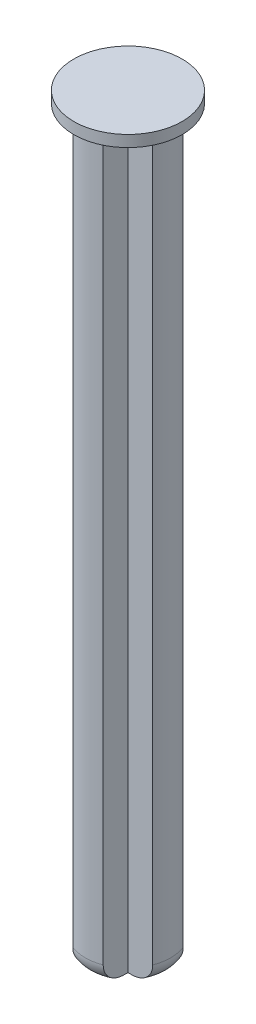
ISO-10303-21;
HEADER;
FILE_DESCRIPTION(('STEP AP214'),'2;1');
FILE_NAME('part.step','',(''),(''),'','','');
FILE_SCHEMA(('AUTOMOTIVE_DESIGN { 1 0 10303 214 1 1 1 1 }'));
ENDSEC;
DATA;
#1=APPLICATION_CONTEXT('core data for automotive mechanical design processes');
#2=APPLICATION_PROTOCOL_DEFINITION('international standard','automotive_design',2000,#1);
#3=PRODUCT_CONTEXT('',#1,'mechanical');
#4=PRODUCT('Part','Part','',(#3));
#5=PRODUCT_RELATED_PRODUCT_CATEGORY('part','',(#4));
#6=PRODUCT_DEFINITION_FORMATION('','',#4);
#7=PRODUCT_DEFINITION_CONTEXT('part definition',#1,'design');
#8=PRODUCT_DEFINITION('design','',#6,#7);
#9=PRODUCT_DEFINITION_SHAPE('','',#8);
#10=(LENGTH_UNIT() NAMED_UNIT(*) SI_UNIT(.MILLI.,.METRE.));
#11=(NAMED_UNIT(*) PLANE_ANGLE_UNIT() SI_UNIT($,.RADIAN.));
#12=(NAMED_UNIT(*) SI_UNIT($,.STERADIAN.) SOLID_ANGLE_UNIT());
#13=UNCERTAINTY_MEASURE_WITH_UNIT(LENGTH_MEASURE(1.E-05),#10,'distance_accuracy_value','');
#14=(GEOMETRIC_REPRESENTATION_CONTEXT(3) GLOBAL_UNCERTAINTY_ASSIGNED_CONTEXT((#13)) GLOBAL_UNIT_ASSIGNED_CONTEXT((#10,
#11,#12)) REPRESENTATION_CONTEXT('',''));
#15=CARTESIAN_POINT('',(0.,0.,0.));
#16=DIRECTION('',(0.,0.,1.));
#17=DIRECTION('',(1.,0.,0.));
#18=AXIS2_PLACEMENT_3D('',#15,#16,#17);
#19=CARTESIAN_POINT('',(0.,85.1639610306789,0.8));
#20=DIRECTION('',(0.,0.,1.));
#21=DIRECTION('',(1.,0.,0.));
#22=AXIS2_PLACEMENT_3D('',#19,#20,#21);
#23=PLANE('',#22);
#24=DIRECTION('',(0.,-1.,0.));
#25=VECTOR('',#24,1.);
#26=CARTESIAN_POINT('',(-0.8,85.1639610306789,0.8));
#27=LINE('',#26,#25);
#28=CARTESIAN_POINT('',(-0.8,38.8,0.8));
#29=VERTEX_POINT('',#28);
#30=CARTESIAN_POINT('',(-0.8,0.,0.8));
#31=VERTEX_POINT('',#30);
#32=EDGE_CURVE('E157',#29,#31,#27,.T.);
#33=ORIENTED_EDGE('',*,*,#32,.F.);
#34=DIRECTION('',(-1.,0.,0.));
#35=VECTOR('',#34,1.);
#36=CARTESIAN_POINT('',(0.,38.8,0.8));
#37=LINE('',#36,#35);
#38=CARTESIAN_POINT('',(-2.10297408448131,38.8,0.8));
#39=VERTEX_POINT('',#38);
#40=EDGE_CURVE('E51',#29,#39,#37,.T.);
#41=ORIENTED_EDGE('',*,*,#40,.T.);
#42=DIRECTION('',(0.,-1.,0.));
#43=VECTOR('',#42,1.);
#44=CARTESIAN_POINT('',(-2.10297408448131,85.1639610306789,0.8));
#45=LINE('',#44,#43);
#46=CARTESIAN_POINT('',(-2.10297408448131,1.,0.8));
#47=VERTEX_POINT('',#46);
#48=EDGE_CURVE('E203',#39,#47,#45,.T.);
#49=ORIENTED_EDGE('',*,*,#48,.T.);
#50=CARTESIAN_POINT('',(-2.10297408448131,1.,0.8));
#51=CARTESIAN_POINT('',(-2.10297441519099,0.973387600106504,0.8));
#52=CARTESIAN_POINT('',(-2.10183671881926,0.946788234788772,0.8));
#53=CARTESIAN_POINT('',(-2.09730154814578,0.893786150099357,0.8));
#54=CARTESIAN_POINT('',(-2.09390435395547,0.867383406762535,0.8));
#55=CARTESIAN_POINT('',(-2.08037447490767,0.788872479617725,0.8));
#56=CARTESIAN_POINT('',(-2.06690326307456,0.7373008130706,0.8));
#57=CARTESIAN_POINT('',(-2.03151447242179,0.637172746290927,0.8));
#58=CARTESIAN_POINT('',(-2.00959603399031,0.588616653515142,0.8));
#59=CARTESIAN_POINT('',(-1.95804557689708,0.495772279122224,0.8));
#60=CARTESIAN_POINT('',(-1.92841114725091,0.451485337406586,0.8));
#61=CARTESIAN_POINT('',(-1.86181339090263,0.367545303764267,0.8));
#62=CARTESIAN_POINT('',(-1.82473011063944,0.327987628350848,0.8));
#63=CARTESIAN_POINT('',(-1.74478452152165,0.255294523486733,0.8));
#64=CARTESIAN_POINT('',(-1.70192492685613,0.222156095461802,0.8));
#65=CARTESIAN_POINT('',(-1.60918015266492,0.16115265864421,0.8));
#66=CARTESIAN_POINT('',(-1.5590375501905,0.1336805187422,0.8));
#67=CARTESIAN_POINT('',(-1.45506030984878,0.0865883798840226,0.8));
#68=CARTESIAN_POINT('',(-1.40121656393664,0.0669886276664464,0.8));
#69=CARTESIAN_POINT('',(-1.30858063711562,0.0404545276200822,0.8));
#70=CARTESIAN_POINT('',(-1.27035259773507,0.0314760707552039,0.8));
#71=CARTESIAN_POINT('',(-1.19321105841374,0.0169711994033569,0.8));
#72=CARTESIAN_POINT('',(-1.15429696866066,0.0114479207597324,0.8));
#73=CARTESIAN_POINT('',(-1.07635302904717,0.00363245821079271,0.8));
#74=CARTESIAN_POINT('',(-1.03732467890741,0.00132458626135063,0.8));
#75=CARTESIAN_POINT('',(-0.95928016050169,-0.000465922976817975,0.8));
#76=CARTESIAN_POINT('',(-0.92026413581677,4.55719735898565E-05,0.8));
#77=CARTESIAN_POINT('',(-0.881330460618863,0.00178541253676217,0.8));
#78=B_SPLINE_CURVE_WITH_KNOTS('',3,(#50,#51,#52,#53,#54,#55,#56,#57,#58,#59,#60,#61,#62,#63,#64,
#65,#66,#67,#68,#69,#70,#71,#72,#73,#74,#75,#76,#77),.UNSPECIFIED.,.F.,.F.,(4,2,2,2,2,2,2,2,2,2,
2,2,2,4),(0.,0.0797871430217843,0.15956439662156,0.318642814270302,0.477737424430208,
0.636881806018965,0.798830788459493,0.960703937505235,1.13152701481513,1.30278665579144,
1.4204396107989,1.53819919069752,1.65538218256064,1.77232138146314),.UNSPECIFIED.);
#79=CARTESIAN_POINT('',(-0.960468635614927,0.,0.8));
#80=VERTEX_POINT('',#79);
#81=EDGE_CURVE('E247',#47,#80,#78,.T.);
#82=ORIENTED_EDGE('',*,*,#81,.T.);
#83=DIRECTION('',(-1.,0.,0.));
#84=VECTOR('',#83,1.);
#85=CARTESIAN_POINT('',(0.,0.,0.8));
#86=LINE('',#85,#84);
#87=EDGE_CURVE('E172',#31,#80,#86,.T.);
#88=ORIENTED_EDGE('',*,*,#87,.F.);
#89=EDGE_LOOP('',(#33,#41,#49,#82,#88));
#90=FACE_BOUND('',#89,.T.);
#91=ADVANCED_FACE('F35',(#90),#23,.T.);
#92=CARTESIAN_POINT('',(0.,85.1639610306789,0.));
#93=DIRECTION('',(0.,-1.,0.));
#94=DIRECTION('',(0.,0.,-1.));
#95=AXIS2_PLACEMENT_3D('',#92,#93,#94);
#96=CYLINDRICAL_SURFACE('',#95,2.25);
#97=CARTESIAN_POINT('',(0.,38.8,0.));
#98=DIRECTION('',(0.,1.,0.));
#99=DIRECTION('',(0.,0.,1.));
#100=AXIS2_PLACEMENT_3D('',#97,#98,#99);
#101=CIRCLE('',#100,2.25);
#102=CARTESIAN_POINT('',(-2.10297408448131,38.8,-0.8));
#103=VERTEX_POINT('',#102);
#104=EDGE_CURVE('E58',#103,#39,#101,.T.);
#105=ORIENTED_EDGE('',*,*,#104,.F.);
#106=DIRECTION('',(0.,-1.,0.));
#107=VECTOR('',#106,1.);
#108=CARTESIAN_POINT('',(-2.10297408448131,85.1639610306789,-0.8));
#109=LINE('',#108,#107);
#110=CARTESIAN_POINT('',(-2.10297408448131,1.,-0.8));
#111=VERTEX_POINT('',#110);
#112=EDGE_CURVE('E217',#103,#111,#109,.T.);
#113=ORIENTED_EDGE('',*,*,#112,.T.);
#114=CARTESIAN_POINT('',(0.,1.,0.));
#115=DIRECTION('',(0.,1.,0.));
#116=DIRECTION('',(0.,0.,1.));
#117=AXIS2_PLACEMENT_3D('',#114,#115,#116);
#118=CIRCLE('',#117,2.25);
#119=EDGE_CURVE('E229',#111,#47,#118,.T.);
#120=ORIENTED_EDGE('',*,*,#119,.T.);
#121=ORIENTED_EDGE('',*,*,#48,.F.);
#122=EDGE_LOOP('',(#105,#113,#120,#121));
#123=FACE_BOUND('',#122,.T.);
#124=ADVANCED_FACE('F258',(#123),#96,.T.);
#125=CARTESIAN_POINT('',(0.,85.1639610306789,-0.799999999999999));
#126=DIRECTION('',(0.,0.,1.));
#127=DIRECTION('',(1.,0.,0.));
#128=AXIS2_PLACEMENT_3D('',#125,#126,#127);
#129=PLANE('',#128);
#130=DIRECTION('',(-1.,0.,0.));
#131=VECTOR('',#130,1.);
#132=CARTESIAN_POINT('',(0.,38.8,-0.799999999999999));
#133=LINE('',#132,#131);
#134=CARTESIAN_POINT('',(-0.8,38.8,-0.799999999999999));
#135=VERTEX_POINT('',#134);
#136=EDGE_CURVE('E177',#135,#103,#133,.T.);
#137=ORIENTED_EDGE('',*,*,#136,.F.);
#138=DIRECTION('',(0.,-1.,0.));
#139=VECTOR('',#138,1.);
#140=CARTESIAN_POINT('',(-0.8,85.1639610306789,-0.799999999999999));
#141=LINE('',#140,#139);
#142=CARTESIAN_POINT('',(-0.8,0.,-0.799999999999999));
#143=VERTEX_POINT('',#142);
#144=EDGE_CURVE('E185',#135,#143,#141,.T.);
#145=ORIENTED_EDGE('',*,*,#144,.T.);
#146=DIRECTION('',(-1.,0.,0.));
#147=VECTOR('',#146,1.);
#148=CARTESIAN_POINT('',(0.,0.,-0.799999999999999));
#149=LINE('',#148,#147);
#150=CARTESIAN_POINT('',(-0.960468635614927,0.,-0.799999999999999));
#151=VERTEX_POINT('',#150);
#152=EDGE_CURVE('E181',#143,#151,#149,.T.);
#153=ORIENTED_EDGE('',*,*,#152,.T.);
#154=CARTESIAN_POINT('',(-2.10297408448131,1.,-0.8));
#155=CARTESIAN_POINT('',(-2.10297441519099,0.973387600106504,-0.8));
#156=CARTESIAN_POINT('',(-2.10183671881926,0.946788234788772,-0.8));
#157=CARTESIAN_POINT('',(-2.09730154814578,0.893786150099357,-0.8));
#158=CARTESIAN_POINT('',(-2.09390435395547,0.867383406762535,-0.8));
#159=CARTESIAN_POINT('',(-2.08037447490767,0.788872479617725,-0.8));
#160=CARTESIAN_POINT('',(-2.06690326307456,0.7373008130706,-0.8));
#161=CARTESIAN_POINT('',(-2.03151447242179,0.637172746290927,-0.8));
#162=CARTESIAN_POINT('',(-2.00959603399031,0.588616653515141,-0.8));
#163=CARTESIAN_POINT('',(-1.95804557689708,0.495772279122224,-0.8));
#164=CARTESIAN_POINT('',(-1.92841114725091,0.451485337406586,-0.8));
#165=CARTESIAN_POINT('',(-1.86181339090263,0.367545303764267,-0.8));
#166=CARTESIAN_POINT('',(-1.82473011063944,0.327987628350848,-0.8));
#167=CARTESIAN_POINT('',(-1.74478452152165,0.255294523486733,-0.8));
#168=CARTESIAN_POINT('',(-1.70192492685613,0.222156095461802,-0.8));
#169=CARTESIAN_POINT('',(-1.60918015266492,0.161152658644209,-0.8));
#170=CARTESIAN_POINT('',(-1.5590375501905,0.1336805187422,-0.8));
#171=CARTESIAN_POINT('',(-1.45506030984878,0.0865883798840224,-0.8));
#172=CARTESIAN_POINT('',(-1.40121656393664,0.0669886276664461,-0.8));
#173=CARTESIAN_POINT('',(-1.30858063711562,0.040454527620082,-0.8));
#174=CARTESIAN_POINT('',(-1.27035259773507,0.0314760707552038,-0.8));
#175=CARTESIAN_POINT('',(-1.19321105841374,0.0169711994033569,-0.8));
#176=CARTESIAN_POINT('',(-1.15429696866066,0.0114479207597322,-0.8));
#177=CARTESIAN_POINT('',(-1.07635302904717,0.00363245821079254,-0.8));
#178=CARTESIAN_POINT('',(-1.03732467890741,0.00132458626135053,-0.8));
#179=CARTESIAN_POINT('',(-0.95928016050169,-0.000465922976817944,-0.8));
#180=CARTESIAN_POINT('',(-0.92026413581677,4.55719735899408E-05,-0.8));
#181=CARTESIAN_POINT('',(-0.881330460618863,0.00178541253676218,-0.799999999999999));
#182=B_SPLINE_CURVE_WITH_KNOTS('',3,(#154,#155,#156,#157,#158,#159,#160,#161,#162,#163,#164,
#165,#166,#167,#168,#169,#170,#171,#172,#173,#174,#175,#176,#177,#178,#179,#180,#181),
.UNSPECIFIED.,.F.,.F.,(4,2,2,2,2,2,2,2,2,2,2,2,2,4),(0.,0.0797871430217844,0.15956439662156,
0.318642814270302,0.477737424430208,0.636881806018965,0.798830788459493,0.960703937505235,
1.13152701481513,1.30278665579144,1.4204396107989,1.53819919069752,1.65538218256064,
1.77232138146314),.UNSPECIFIED.);
#183=EDGE_CURVE('E205',#151,#111,#182,.F.);
#184=ORIENTED_EDGE('',*,*,#183,.T.);
#185=ORIENTED_EDGE('',*,*,#112,.F.);
#186=EDGE_LOOP('',(#137,#145,#153,#184,#185));
#187=FACE_BOUND('',#186,.T.);
#188=ADVANCED_FACE('F231',(#187),#129,.F.);
#189=CARTESIAN_POINT('',(-0.8,85.1639610306789,0.));
#190=DIRECTION('',(1.,0.,0.));
#191=DIRECTION('',(0.,0.,-1.));
#192=AXIS2_PLACEMENT_3D('',#189,#190,#191);
#193=PLANE('',#192);
#194=DIRECTION('',(0.,0.,1.));
#195=VECTOR('',#194,1.);
#196=CARTESIAN_POINT('',(-0.8,38.8,0.));
#197=LINE('',#196,#195);
#198=CARTESIAN_POINT('',(-0.8,38.8,-2.10297408448131));
#199=VERTEX_POINT('',#198);
#200=EDGE_CURVE('E272',#199,#135,#197,.T.);
#201=ORIENTED_EDGE('',*,*,#200,.F.);
#202=DIRECTION('',(0.,-1.,0.));
#203=VECTOR('',#202,1.);
#204=CARTESIAN_POINT('',(-0.8,85.1639610306789,-2.10297408448131));
#205=LINE('',#204,#203);
#206=CARTESIAN_POINT('',(-0.8,1.,-2.10297408448131));
#207=VERTEX_POINT('',#206);
#208=EDGE_CURVE('E184',#199,#207,#205,.T.);
#209=ORIENTED_EDGE('',*,*,#208,.T.);
#210=CARTESIAN_POINT('',(-0.8,0.,-0.960468635614925));
#211=CARTESIAN_POINT('',(-0.8,-1.61764964313199E-05,-1.00089695630695));
#212=CARTESIAN_POINT('',(-0.8,0.00144818212186802,-1.04135644001157));
#213=CARTESIAN_POINT('',(-0.8,0.00767669478763478,-1.12210556981698));
#214=CARTESIAN_POINT('',(-0.8,0.0124481206118231,-1.16239464440969));
#215=CARTESIAN_POINT('',(-0.8,0.0256616351639781,-1.2425662880405));
#216=CARTESIAN_POINT('',(-0.8,0.0341198463909614,-1.282446275031));
#217=CARTESIAN_POINT('',(-0.8,0.0549081289711817,-1.36114029720907));
#218=CARTESIAN_POINT('',(-0.8,0.0672343933106843,-1.3999553398635));
#219=CARTESIAN_POINT('',(-0.8,0.102795963285697,-1.4944179562022));
#220=CARTESIAN_POINT('',(-0.8,0.12842720292967,-1.54919260462306));
#221=CARTESIAN_POINT('',(-0.8,0.188375508128817,-1.65360012896897));
#222=CARTESIAN_POINT('',(-0.8,0.222670443257998,-1.70324565812819));
#223=CARTESIAN_POINT('',(-0.8,0.299616852426918,-1.79603926480535));
#224=CARTESIAN_POINT('',(-0.8,0.342309233498008,-1.83915362988897));
#225=CARTESIAN_POINT('',(-0.8,0.43488345070996,-1.9168989589252));
#226=CARTESIAN_POINT('',(-0.8,0.48476794590266,-1.95152677240901));
#227=CARTESIAN_POINT('',(-0.8,0.58612472520233,-2.00855639669966));
#228=CARTESIAN_POINT('',(-0.8,0.637186654384494,-2.03168854833522));
#229=CARTESIAN_POINT('',(-0.8,0.742571357803405,-2.06858837607197));
#230=CARTESIAN_POINT('',(-0.8,0.796892659430562,-2.08236024706169));
#231=CARTESIAN_POINT('',(-0.8,0.904612915528465,-2.09961483561991));
#232=CARTESIAN_POINT('',(-0.8,0.957940063237049,-2.10354013891284));
#233=CARTESIAN_POINT('',(-0.8,1.03783619721989,-2.1025903267386));
#234=CARTESIAN_POINT('',(-0.8,1.06448423244251,-2.10112824842795));
#235=CARTESIAN_POINT('',(-0.8,1.11756125080896,-2.09593591392812));
#236=CARTESIAN_POINT('',(-0.8,1.14399021113603,-2.09220542441802));
#237=CARTESIAN_POINT('',(-0.8,1.17022385903395,-2.0873517630733));
#238=B_SPLINE_CURVE_WITH_KNOTS('',3,(#210,#211,#212,#213,#214,#215,#216,#217,#218,#219,#220,
#221,#222,#223,#224,#225,#226,#227,#228,#229,#230,#231,#232,#233,#234,#235,#236,#237),
.UNSPECIFIED.,.F.,.F.,(4,2,2,2,2,2,2,2,2,2,2,2,2,4),(0.,0.121303589835471,0.242874758970373,
0.364982984046552,0.486971402768664,0.667571261450087,0.847714382291364,1.02875780759105,
1.20986834031537,1.37718388598393,1.5444243982526,1.70400101691868,1.78398051140163,
1.86396823369),.UNSPECIFIED.);
#239=CARTESIAN_POINT('',(-0.8,0.,-0.960468635614925));
#240=VERTEX_POINT('',#239);
#241=EDGE_CURVE('E386',#207,#240,#238,.F.);
#242=ORIENTED_EDGE('',*,*,#241,.T.);
#243=DIRECTION('',(0.,0.,1.));
#244=VECTOR('',#243,1.);
#245=CARTESIAN_POINT('',(-0.8,0.,0.));
#246=LINE('',#245,#244);
#247=EDGE_CURVE('E186',#240,#143,#246,.T.);
#248=ORIENTED_EDGE('',*,*,#247,.T.);
#249=ORIENTED_EDGE('',*,*,#144,.F.);
#250=EDGE_LOOP('',(#201,#209,#242,#248,#249));
#251=FACE_BOUND('',#250,.T.);
#252=ADVANCED_FACE('F263',(#251),#193,.F.);
#253=CARTESIAN_POINT('',(0.,85.1639610306789,0.));
#254=DIRECTION('',(0.,-1.,0.));
#255=DIRECTION('',(0.,0.,-1.));
#256=AXIS2_PLACEMENT_3D('',#253,#254,#255);
#257=CYLINDRICAL_SURFACE('',#256,2.25);
#258=CARTESIAN_POINT('',(0.,38.8,0.));
#259=DIRECTION('',(0.,1.,0.));
#260=DIRECTION('',(0.,0.,1.));
#261=AXIS2_PLACEMENT_3D('',#258,#259,#260);
#262=CIRCLE('',#261,2.25);
#263=CARTESIAN_POINT('',(0.8,38.8,-2.10297408448131));
#264=VERTEX_POINT('',#263);
#265=EDGE_CURVE('E279',#264,#199,#262,.T.);
#266=ORIENTED_EDGE('',*,*,#265,.F.);
#267=DIRECTION('',(0.,-1.,0.));
#268=VECTOR('',#267,1.);
#269=CARTESIAN_POINT('',(0.8,85.1639610306789,-2.10297408448131));
#270=LINE('',#269,#268);
#271=CARTESIAN_POINT('',(0.8,1.,-2.10297408448131));
#272=VERTEX_POINT('',#271);
#273=EDGE_CURVE('E189',#264,#272,#270,.T.);
#274=ORIENTED_EDGE('',*,*,#273,.T.);
#275=CARTESIAN_POINT('',(0.,1.,0.));
#276=DIRECTION('',(0.,1.,0.));
#277=DIRECTION('',(0.,0.,1.));
#278=AXIS2_PLACEMENT_3D('',#275,#276,#277);
#279=CIRCLE('',#278,2.25);
#280=EDGE_CURVE('E44',#272,#207,#279,.T.);
#281=ORIENTED_EDGE('',*,*,#280,.T.);
#282=ORIENTED_EDGE('',*,*,#208,.F.);
#283=EDGE_LOOP('',(#266,#274,#281,#282));
#284=FACE_BOUND('',#283,.T.);
#285=ADVANCED_FACE('F268',(#284),#257,.T.);
#286=CARTESIAN_POINT('',(0.8,85.1639610306789,0.));
#287=DIRECTION('',(1.,0.,0.));
#288=DIRECTION('',(0.,0.,-1.));
#289=AXIS2_PLACEMENT_3D('',#286,#287,#288);
#290=PLANE('',#289);
#291=ORIENTED_EDGE('',*,*,#273,.F.);
#292=DIRECTION('',(0.,0.,1.));
#293=VECTOR('',#292,1.);
#294=CARTESIAN_POINT('',(0.8,38.8,0.));
#295=LINE('',#294,#293);
#296=CARTESIAN_POINT('',(0.8,38.8,-0.799999999999999));
#297=VERTEX_POINT('',#296);
#298=EDGE_CURVE('E281',#264,#297,#295,.T.);
#299=ORIENTED_EDGE('',*,*,#298,.T.);
#300=DIRECTION('',(0.,-1.,0.));
#301=VECTOR('',#300,1.);
#302=CARTESIAN_POINT('',(0.8,85.1639610306789,-0.799999999999999));
#303=LINE('',#302,#301);
#304=CARTESIAN_POINT('',(0.8,0.,-0.799999999999999));
#305=VERTEX_POINT('',#304);
#306=EDGE_CURVE('E212',#297,#305,#303,.T.);
#307=ORIENTED_EDGE('',*,*,#306,.T.);
#308=DIRECTION('',(0.,0.,1.));
#309=VECTOR('',#308,1.);
#310=CARTESIAN_POINT('',(0.8,0.,0.));
#311=LINE('',#310,#309);
#312=CARTESIAN_POINT('',(0.8,0.,-0.960468635614925));
#313=VERTEX_POINT('',#312);
#314=EDGE_CURVE('E175',#313,#305,#311,.T.);
#315=ORIENTED_EDGE('',*,*,#314,.F.);
#316=CARTESIAN_POINT('',(0.8,1.,-2.10297408448131));
#317=CARTESIAN_POINT('',(0.8,0.973387600106505,-2.10297441519099));
#318=CARTESIAN_POINT('',(0.8,0.946788234788772,-2.10183671881926));
#319=CARTESIAN_POINT('',(0.8,0.893786150099357,-2.09730154814578));
#320=CARTESIAN_POINT('',(0.8,0.867383406762535,-2.09390435395547));
#321=CARTESIAN_POINT('',(0.8,0.788872479617725,-2.08037447490767));
#322=CARTESIAN_POINT('',(0.8,0.7373008130706,-2.06690326307456));
#323=CARTESIAN_POINT('',(0.8,0.637172746290927,-2.03151447242179));
#324=CARTESIAN_POINT('',(0.8,0.588616653515142,-2.0095960339903));
#325=CARTESIAN_POINT('',(0.8,0.495772279122224,-1.95804557689707));
#326=CARTESIAN_POINT('',(0.8,0.451485337406586,-1.92841114725091));
#327=CARTESIAN_POINT('',(0.8,0.367545303764267,-1.86181339090263));
#328=CARTESIAN_POINT('',(0.8,0.327987628350848,-1.82473011063944));
#329=CARTESIAN_POINT('',(0.8,0.255294523486733,-1.74478452152165));
#330=CARTESIAN_POINT('',(0.8,0.222156095461802,-1.70192492685613));
#331=CARTESIAN_POINT('',(0.8,0.16115265864421,-1.60918015266492));
#332=CARTESIAN_POINT('',(0.8,0.1336805187422,-1.5590375501905));
#333=CARTESIAN_POINT('',(0.8,0.0865883798840228,-1.45506030984878));
#334=CARTESIAN_POINT('',(0.8,0.0669886276664466,-1.40121656393664));
#335=CARTESIAN_POINT('',(0.8,0.0404545276200823,-1.30858063711561));
#336=CARTESIAN_POINT('',(0.8,0.0314760707552039,-1.27035259773506));
#337=CARTESIAN_POINT('',(0.8,0.0169711994033569,-1.19321105841374));
#338=CARTESIAN_POINT('',(0.8,0.0114479207597323,-1.15429696866065));
#339=CARTESIAN_POINT('',(0.8,0.00363245821079272,-1.07635302904717));
#340=CARTESIAN_POINT('',(0.8,0.00132458626135065,-1.03732467890741));
#341=CARTESIAN_POINT('',(0.8,-0.000465922976817923,-0.959280160501689));
#342=CARTESIAN_POINT('',(0.8,4.55719735899429E-05,-0.920264135816769));
#343=CARTESIAN_POINT('',(0.8,0.00178541253676232,-0.881330460618862));
#344=B_SPLINE_CURVE_WITH_KNOTS('',3,(#316,#317,#318,#319,#320,#321,#322,#323,#324,#325,#326,
#327,#328,#329,#330,#331,#332,#333,#334,#335,#336,#337,#338,#339,#340,#341,#342,#343),
.UNSPECIFIED.,.F.,.F.,(4,2,2,2,2,2,2,2,2,2,2,2,2,4),(0.,0.079787143021784,0.159564396621559,
0.318642814270301,0.477737424430208,0.636881806018965,0.798830788459493,0.960703937505235,
1.13152701481513,1.30278665579144,1.4204396107989,1.53819919069752,1.65538218256064,
1.77232138146314),.UNSPECIFIED.);
#345=EDGE_CURVE('E390',#313,#272,#344,.F.);
#346=ORIENTED_EDGE('',*,*,#345,.T.);
#347=EDGE_LOOP('',(#291,#299,#307,#315,#346));
#348=FACE_BOUND('',#347,.T.);
#349=ADVANCED_FACE('F369',(#348),#290,.T.);
#350=CARTESIAN_POINT('',(0.,85.1639610306789,-0.8));
#351=DIRECTION('',(0.,0.,1.));
#352=DIRECTION('',(1.,0.,0.));
#353=AXIS2_PLACEMENT_3D('',#350,#351,#352);
#354=PLANE('',#353);
#355=DIRECTION('',(-1.,0.,0.));
#356=VECTOR('',#355,1.);
#357=CARTESIAN_POINT('',(0.,38.8,-0.8));
#358=LINE('',#357,#356);
#359=CARTESIAN_POINT('',(2.10297408448131,38.8,-0.799999999999999));
#360=VERTEX_POINT('',#359);
#361=EDGE_CURVE('E285',#360,#297,#358,.T.);
#362=ORIENTED_EDGE('',*,*,#361,.F.);
#363=DIRECTION('',(0.,-1.,0.));
#364=VECTOR('',#363,1.);
#365=CARTESIAN_POINT('',(2.10297408448131,85.1639610306789,-0.799999999999999));
#366=LINE('',#365,#364);
#367=CARTESIAN_POINT('',(2.10297408448131,1.,-0.799999999999999));
#368=VERTEX_POINT('',#367);
#369=EDGE_CURVE('E197',#360,#368,#366,.T.);
#370=ORIENTED_EDGE('',*,*,#369,.T.);
#371=CARTESIAN_POINT('',(0.960468635614927,0.,-0.799999999999999));
#372=CARTESIAN_POINT('',(1.00089695630696,-1.61764964313008E-05,-0.799999999999999));
#373=CARTESIAN_POINT('',(1.04135644001157,0.00144818212186804,-0.799999999999999));
#374=CARTESIAN_POINT('',(1.12210556981698,0.00767669478763476,-0.799999999999999));
#375=CARTESIAN_POINT('',(1.16239464440969,0.0124481206118231,-0.799999999999999));
#376=CARTESIAN_POINT('',(1.2425662880405,0.025661635163978,-0.799999999999999));
#377=CARTESIAN_POINT('',(1.28244627503101,0.0341198463909612,-0.799999999999999));
#378=CARTESIAN_POINT('',(1.36114029720907,0.0549081289711815,-0.799999999999999));
#379=CARTESIAN_POINT('',(1.3999553398635,0.0672343933106841,-0.799999999999999));
#380=CARTESIAN_POINT('',(1.4944179562022,0.102795963285696,-0.799999999999999));
#381=CARTESIAN_POINT('',(1.54919260462306,0.128427202929669,-0.799999999999999));
#382=CARTESIAN_POINT('',(1.65360012896897,0.188375508128816,-0.799999999999999));
#383=CARTESIAN_POINT('',(1.70324565812819,0.222670443257998,-0.799999999999999));
#384=CARTESIAN_POINT('',(1.79603926480535,0.299616852426918,-0.799999999999999));
#385=CARTESIAN_POINT('',(1.83915362988897,0.342309233498007,-0.799999999999999));
#386=CARTESIAN_POINT('',(1.9168989589252,0.43488345070996,-0.799999999999999));
#387=CARTESIAN_POINT('',(1.95152677240901,0.48476794590266,-0.799999999999999));
#388=CARTESIAN_POINT('',(2.00855639669967,0.58612472520233,-0.799999999999999));
#389=CARTESIAN_POINT('',(2.03168854833522,0.637186654384494,-0.799999999999999));
#390=CARTESIAN_POINT('',(2.06858837607197,0.742571357803405,-0.799999999999999));
#391=CARTESIAN_POINT('',(2.08236024706169,0.796892659430562,-0.799999999999999));
#392=CARTESIAN_POINT('',(2.09961483561991,0.904612915528465,-0.799999999999999));
#393=CARTESIAN_POINT('',(2.10354013891284,0.957940063237049,-0.799999999999999));
#394=CARTESIAN_POINT('',(2.1025903267386,1.03783619721989,-0.799999999999999));
#395=CARTESIAN_POINT('',(2.10112824842796,1.06448423244251,-0.799999999999999));
#396=CARTESIAN_POINT('',(2.09593591392812,1.11756125080897,-0.799999999999999));
#397=CARTESIAN_POINT('',(2.09220542441802,1.14399021113603,-0.799999999999999));
#398=CARTESIAN_POINT('',(2.0873517630733,1.17022385903395,-0.799999999999999));
#399=B_SPLINE_CURVE_WITH_KNOTS('',3,(#371,#372,#373,#374,#375,#376,#377,#378,#379,#380,#381,
#382,#383,#384,#385,#386,#387,#388,#389,#390,#391,#392,#393,#394,#395,#396,#397,#398),
.UNSPECIFIED.,.F.,.F.,(4,2,2,2,2,2,2,2,2,2,2,2,2,4),(0.,0.121303589835471,0.242874758970373,
0.364982984046551,0.486971402768663,0.667571261450086,0.847714382291363,1.02875780759104,
1.20986834031536,1.37718388598393,1.5444243982526,1.70400101691868,1.78398051140163,
1.86396823369),.UNSPECIFIED.);
#400=CARTESIAN_POINT('',(0.960468635614927,0.,-0.799999999999999));
#401=VERTEX_POINT('',#400);
#402=EDGE_CURVE('E328',#368,#401,#399,.F.);
#403=ORIENTED_EDGE('',*,*,#402,.T.);
#404=DIRECTION('',(-1.,0.,0.));
#405=VECTOR('',#404,1.);
#406=CARTESIAN_POINT('',(0.,0.,-0.8));
#407=LINE('',#406,#405);
#408=EDGE_CURVE('E193',#401,#305,#407,.T.);
#409=ORIENTED_EDGE('',*,*,#408,.T.);
#410=ORIENTED_EDGE('',*,*,#306,.F.);
#411=EDGE_LOOP('',(#362,#370,#403,#409,#410));
#412=FACE_BOUND('',#411,.T.);
#413=ADVANCED_FACE('F338',(#412),#354,.F.);
#414=CARTESIAN_POINT('',(0.,85.1639610306789,0.));
#415=DIRECTION('',(0.,-1.,0.));
#416=DIRECTION('',(0.,0.,-1.));
#417=AXIS2_PLACEMENT_3D('',#414,#415,#416);
#418=CYLINDRICAL_SURFACE('',#417,2.25);
#419=CARTESIAN_POINT('',(0.,38.8,0.));
#420=DIRECTION('',(0.,1.,0.));
#421=DIRECTION('',(0.,0.,1.));
#422=AXIS2_PLACEMENT_3D('',#419,#420,#421);
#423=CIRCLE('',#422,2.25);
#424=CARTESIAN_POINT('',(2.10297408448131,38.8,0.8));
#425=VERTEX_POINT('',#424);
#426=EDGE_CURVE('E288',#425,#360,#423,.T.);
#427=ORIENTED_EDGE('',*,*,#426,.F.);
#428=DIRECTION('',(0.,-1.,0.));
#429=VECTOR('',#428,1.);
#430=CARTESIAN_POINT('',(2.10297408448131,85.1639610306789,0.8));
#431=LINE('',#430,#429);
#432=CARTESIAN_POINT('',(2.10297408448131,1.,0.8));
#433=VERTEX_POINT('',#432);
#434=EDGE_CURVE('E196',#425,#433,#431,.T.);
#435=ORIENTED_EDGE('',*,*,#434,.T.);
#436=CARTESIAN_POINT('',(0.,1.,0.));
#437=DIRECTION('',(0.,1.,0.));
#438=DIRECTION('',(0.,0.,1.));
#439=AXIS2_PLACEMENT_3D('',#436,#437,#438);
#440=CIRCLE('',#439,2.25);
#441=EDGE_CURVE('E355',#433,#368,#440,.T.);
#442=ORIENTED_EDGE('',*,*,#441,.T.);
#443=ORIENTED_EDGE('',*,*,#369,.F.);
#444=EDGE_LOOP('',(#427,#435,#442,#443));
#445=FACE_BOUND('',#444,.T.);
#446=ADVANCED_FACE('F361',(#445),#418,.T.);
#447=CARTESIAN_POINT('',(0.,85.1639610306789,0.8));
#448=DIRECTION('',(0.,0.,1.));
#449=DIRECTION('',(1.,0.,0.));
#450=AXIS2_PLACEMENT_3D('',#447,#448,#449);
#451=PLANE('',#450);
#452=ORIENTED_EDGE('',*,*,#434,.F.);
#453=DIRECTION('',(-1.,0.,0.));
#454=VECTOR('',#453,1.);
#455=CARTESIAN_POINT('',(0.,38.8,0.8));
#456=LINE('',#455,#454);
#457=CARTESIAN_POINT('',(0.8,38.8,0.8));
#458=VERTEX_POINT('',#457);
#459=EDGE_CURVE('E291',#425,#458,#456,.T.);
#460=ORIENTED_EDGE('',*,*,#459,.T.);
#461=DIRECTION('',(0.,-1.,0.));
#462=VECTOR('',#461,1.);
#463=CARTESIAN_POINT('',(0.8,85.1639610306789,0.8));
#464=LINE('',#463,#462);
#465=CARTESIAN_POINT('',(0.8,0.,0.8));
#466=VERTEX_POINT('',#465);
#467=EDGE_CURVE('E208',#458,#466,#464,.T.);
#468=ORIENTED_EDGE('',*,*,#467,.T.);
#469=DIRECTION('',(-1.,0.,0.));
#470=VECTOR('',#469,1.);
#471=CARTESIAN_POINT('',(0.,0.,0.8));
#472=LINE('',#471,#470);
#473=CARTESIAN_POINT('',(0.960468635614926,0.,0.8));
#474=VERTEX_POINT('',#473);
#475=EDGE_CURVE('E192',#474,#466,#472,.T.);
#476=ORIENTED_EDGE('',*,*,#475,.F.);
#477=CARTESIAN_POINT('',(2.10297408448131,1.,0.8));
#478=CARTESIAN_POINT('',(2.10297441519099,0.973387600106504,0.8));
#479=CARTESIAN_POINT('',(2.10183671881926,0.946788234788772,0.8));
#480=CARTESIAN_POINT('',(2.09730154814578,0.893786150099357,0.8));
#481=CARTESIAN_POINT('',(2.09390435395547,0.867383406762535,0.8));
#482=CARTESIAN_POINT('',(2.08037447490767,0.788872479617725,0.8));
#483=CARTESIAN_POINT('',(2.06690326307456,0.7373008130706,0.8));
#484=CARTESIAN_POINT('',(2.03151447242179,0.637172746290927,0.8));
#485=CARTESIAN_POINT('',(2.00959603399031,0.588616653515141,0.8));
#486=CARTESIAN_POINT('',(1.95804557689708,0.495772279122224,0.8));
#487=CARTESIAN_POINT('',(1.92841114725091,0.451485337406586,0.8));
#488=CARTESIAN_POINT('',(1.86181339090263,0.367545303764267,0.8));
#489=CARTESIAN_POINT('',(1.82473011063944,0.327987628350848,0.8));
#490=CARTESIAN_POINT('',(1.74478452152165,0.255294523486733,0.8));
#491=CARTESIAN_POINT('',(1.70192492685613,0.222156095461802,0.8));
#492=CARTESIAN_POINT('',(1.60918015266492,0.16115265864421,0.8));
#493=CARTESIAN_POINT('',(1.5590375501905,0.1336805187422,0.8));
#494=CARTESIAN_POINT('',(1.45506030984878,0.0865883798840226,0.8));
#495=CARTESIAN_POINT('',(1.40121656393664,0.0669886276664462,0.8));
#496=CARTESIAN_POINT('',(1.30858063711561,0.0404545276200821,0.8));
#497=CARTESIAN_POINT('',(1.27035259773507,0.0314760707552039,0.8));
#498=CARTESIAN_POINT('',(1.19321105841374,0.0169711994033569,0.8));
#499=CARTESIAN_POINT('',(1.15429696866066,0.0114479207597323,0.8));
#500=CARTESIAN_POINT('',(1.07635302904717,0.00363245821079255,0.8));
#501=CARTESIAN_POINT('',(1.03732467890741,0.00132458626135043,0.8));
#502=CARTESIAN_POINT('',(0.959280160501689,-0.000465922976818134,0.8));
#503=CARTESIAN_POINT('',(0.920264135816769,4.55719735897716E-05,0.8));
#504=CARTESIAN_POINT('',(0.881330460618862,0.00178541253676225,0.8));
#505=B_SPLINE_CURVE_WITH_KNOTS('',3,(#477,#478,#479,#480,#481,#482,#483,#484,#485,#486,#487,
#488,#489,#490,#491,#492,#493,#494,#495,#496,#497,#498,#499,#500,#501,#502,#503,#504),
.UNSPECIFIED.,.F.,.F.,(4,2,2,2,2,2,2,2,2,2,2,2,2,4),(0.,0.0797871430217843,0.15956439662156,
0.318642814270302,0.477737424430208,0.636881806018965,0.798830788459493,0.960703937505235,
1.13152701481513,1.30278665579144,1.4204396107989,1.53819919069752,1.65538218256064,
1.77232138146315),.UNSPECIFIED.);
#506=EDGE_CURVE('E347',#474,#433,#505,.F.);
#507=ORIENTED_EDGE('',*,*,#506,.T.);
#508=EDGE_LOOP('',(#452,#460,#468,#476,#507));
#509=FACE_BOUND('',#508,.T.);
#510=ADVANCED_FACE('F357',(#509),#451,.T.);
#511=CARTESIAN_POINT('',(0.8,85.1639610306789,0.));
#512=DIRECTION('',(1.,0.,0.));
#513=DIRECTION('',(0.,0.,-1.));
#514=AXIS2_PLACEMENT_3D('',#511,#512,#513);
#515=PLANE('',#514);
#516=ORIENTED_EDGE('',*,*,#467,.F.);
#517=DIRECTION('',(0.,0.,1.));
#518=VECTOR('',#517,1.);
#519=CARTESIAN_POINT('',(0.8,38.8,0.));
#520=LINE('',#519,#518);
#521=CARTESIAN_POINT('',(0.8,38.8,2.10297408448131));
#522=VERTEX_POINT('',#521);
#523=EDGE_CURVE('E166',#458,#522,#520,.T.);
#524=ORIENTED_EDGE('',*,*,#523,.T.);
#525=DIRECTION('',(0.,-1.,0.));
#526=VECTOR('',#525,1.);
#527=CARTESIAN_POINT('',(0.8,85.1639610306789,2.10297408448131));
#528=LINE('',#527,#526);
#529=CARTESIAN_POINT('',(0.8,1.,2.10297408448131));
#530=VERTEX_POINT('',#529);
#531=EDGE_CURVE('E158',#522,#530,#528,.T.);
#532=ORIENTED_EDGE('',*,*,#531,.T.);
#533=CARTESIAN_POINT('',(0.8,0.,0.960468635614925));
#534=CARTESIAN_POINT('',(0.8,-1.61764964313199E-05,1.00089695630695));
#535=CARTESIAN_POINT('',(0.8,0.00144818212186802,1.04135644001157));
#536=CARTESIAN_POINT('',(0.8,0.00767669478763478,1.12210556981698));
#537=CARTESIAN_POINT('',(0.8,0.0124481206118231,1.16239464440969));
#538=CARTESIAN_POINT('',(0.8,0.0256616351639781,1.2425662880405));
#539=CARTESIAN_POINT('',(0.8,0.0341198463909614,1.282446275031));
#540=CARTESIAN_POINT('',(0.8,0.0549081289711817,1.36114029720907));
#541=CARTESIAN_POINT('',(0.8,0.0672343933106843,1.3999553398635));
#542=CARTESIAN_POINT('',(0.8,0.102795963285697,1.4944179562022));
#543=CARTESIAN_POINT('',(0.8,0.12842720292967,1.54919260462306));
#544=CARTESIAN_POINT('',(0.8,0.188375508128817,1.65360012896897));
#545=CARTESIAN_POINT('',(0.8,0.222670443257998,1.70324565812819));
#546=CARTESIAN_POINT('',(0.8,0.299616852426918,1.79603926480535));
#547=CARTESIAN_POINT('',(0.8,0.342309233498008,1.83915362988897));
#548=CARTESIAN_POINT('',(0.8,0.43488345070996,1.9168989589252));
#549=CARTESIAN_POINT('',(0.8,0.48476794590266,1.95152677240901));
#550=CARTESIAN_POINT('',(0.8,0.58612472520233,2.00855639669966));
#551=CARTESIAN_POINT('',(0.8,0.637186654384494,2.03168854833522));
#552=CARTESIAN_POINT('',(0.8,0.742571357803405,2.06858837607197));
#553=CARTESIAN_POINT('',(0.8,0.796892659430562,2.08236024706169));
#554=CARTESIAN_POINT('',(0.8,0.904612915528465,2.09961483561991));
#555=CARTESIAN_POINT('',(0.8,0.957940063237049,2.10354013891284));
#556=CARTESIAN_POINT('',(0.8,1.03783619721989,2.1025903267386));
#557=CARTESIAN_POINT('',(0.8,1.06448423244251,2.10112824842795));
#558=CARTESIAN_POINT('',(0.8,1.11756125080896,2.09593591392812));
#559=CARTESIAN_POINT('',(0.8,1.14399021113603,2.09220542441802));
#560=CARTESIAN_POINT('',(0.8,1.17022385903395,2.0873517630733));
#561=B_SPLINE_CURVE_WITH_KNOTS('',3,(#533,#534,#535,#536,#537,#538,#539,#540,#541,#542,#543,
#544,#545,#546,#547,#548,#549,#550,#551,#552,#553,#554,#555,#556,#557,#558,#559,#560),
.UNSPECIFIED.,.F.,.F.,(4,2,2,2,2,2,2,2,2,2,2,2,2,4),(0.,0.121303589835471,0.242874758970373,
0.364982984046552,0.486971402768664,0.667571261450087,0.847714382291364,1.02875780759105,
1.20986834031537,1.37718388598393,1.5444243982526,1.70400101691868,1.78398051140163,
1.86396823369),.UNSPECIFIED.);
#562=CARTESIAN_POINT('',(0.8,0.,0.960468635614925));
#563=VERTEX_POINT('',#562);
#564=EDGE_CURVE('E422',#530,#563,#561,.F.);
#565=ORIENTED_EDGE('',*,*,#564,.T.);
#566=DIRECTION('',(0.,0.,1.));
#567=VECTOR('',#566,1.);
#568=CARTESIAN_POINT('',(0.8,0.,0.));
#569=LINE('',#568,#567);
#570=EDGE_CURVE('E200',#466,#563,#569,.T.);
#571=ORIENTED_EDGE('',*,*,#570,.F.);
#572=EDGE_LOOP('',(#516,#524,#532,#565,#571));
#573=FACE_BOUND('',#572,.T.);
#574=ADVANCED_FACE('F360',(#573),#515,.T.);
#575=CARTESIAN_POINT('',(0.,85.1639610306789,0.));
#576=DIRECTION('',(0.,-1.,0.));
#577=DIRECTION('',(0.,0.,-1.));
#578=AXIS2_PLACEMENT_3D('',#575,#576,#577);
#579=CYLINDRICAL_SURFACE('',#578,2.25);
#580=CARTESIAN_POINT('',(0.,38.8,0.));
#581=DIRECTION('',(0.,1.,0.));
#582=DIRECTION('',(0.,0.,1.));
#583=AXIS2_PLACEMENT_3D('',#580,#581,#582);
#584=CIRCLE('',#583,2.25);
#585=CARTESIAN_POINT('',(-0.8,38.8,2.10297408448131));
#586=VERTEX_POINT('',#585);
#587=EDGE_CURVE('E162',#586,#522,#584,.T.);
#588=ORIENTED_EDGE('',*,*,#587,.F.);
#589=DIRECTION('',(0.,-1.,0.));
#590=VECTOR('',#589,1.);
#591=CARTESIAN_POINT('',(-0.8,85.1639610306789,2.10297408448131));
#592=LINE('',#591,#590);
#593=CARTESIAN_POINT('',(-0.8,1.,2.10297408448131));
#594=VERTEX_POINT('',#593);
#595=EDGE_CURVE('E149',#586,#594,#592,.T.);
#596=ORIENTED_EDGE('',*,*,#595,.T.);
#597=CARTESIAN_POINT('',(0.,1.,0.));
#598=DIRECTION('',(0.,1.,0.));
#599=DIRECTION('',(0.,0.,1.));
#600=AXIS2_PLACEMENT_3D('',#597,#598,#599);
#601=CIRCLE('',#600,2.25);
#602=EDGE_CURVE('E325',#594,#530,#601,.T.);
#603=ORIENTED_EDGE('',*,*,#602,.T.);
#604=ORIENTED_EDGE('',*,*,#531,.F.);
#605=EDGE_LOOP('',(#588,#596,#603,#604));
#606=FACE_BOUND('',#605,.T.);
#607=ADVANCED_FACE('F163',(#606),#579,.T.);
#608=CARTESIAN_POINT('',(-0.8,85.1639610306789,0.));
#609=DIRECTION('',(1.,0.,0.));
#610=DIRECTION('',(0.,0.,-1.));
#611=AXIS2_PLACEMENT_3D('',#608,#609,#610);
#612=PLANE('',#611);
#613=DIRECTION('',(0.,0.,1.));
#614=VECTOR('',#613,1.);
#615=CARTESIAN_POINT('',(-0.8,38.8,0.));
#616=LINE('',#615,#614);
#617=EDGE_CURVE('E12',#29,#586,#616,.T.);
#618=ORIENTED_EDGE('',*,*,#617,.F.);
#619=ORIENTED_EDGE('',*,*,#32,.T.);
#620=DIRECTION('',(0.,0.,1.));
#621=VECTOR('',#620,1.);
#622=CARTESIAN_POINT('',(-0.8,0.,0.));
#623=LINE('',#622,#621);
#624=CARTESIAN_POINT('',(-0.8,0.,0.960468635614925));
#625=VERTEX_POINT('',#624);
#626=EDGE_CURVE('E204',#31,#625,#623,.T.);
#627=ORIENTED_EDGE('',*,*,#626,.T.);
#628=CARTESIAN_POINT('',(-0.8,1.,2.10297408448131));
#629=CARTESIAN_POINT('',(-0.8,0.973387600106505,2.10297441519099));
#630=CARTESIAN_POINT('',(-0.8,0.946788234788772,2.10183671881926));
#631=CARTESIAN_POINT('',(-0.8,0.893786150099357,2.09730154814578));
#632=CARTESIAN_POINT('',(-0.8,0.867383406762535,2.09390435395547));
#633=CARTESIAN_POINT('',(-0.8,0.788872479617725,2.08037447490767));
#634=CARTESIAN_POINT('',(-0.8,0.7373008130706,2.06690326307456));
#635=CARTESIAN_POINT('',(-0.8,0.637172746290927,2.03151447242179));
#636=CARTESIAN_POINT('',(-0.8,0.588616653515142,2.0095960339903));
#637=CARTESIAN_POINT('',(-0.8,0.495772279122224,1.95804557689707));
#638=CARTESIAN_POINT('',(-0.8,0.451485337406586,1.92841114725091));
#639=CARTESIAN_POINT('',(-0.8,0.367545303764267,1.86181339090263));
#640=CARTESIAN_POINT('',(-0.8,0.327987628350848,1.82473011063944));
#641=CARTESIAN_POINT('',(-0.8,0.255294523486733,1.74478452152165));
#642=CARTESIAN_POINT('',(-0.8,0.222156095461802,1.70192492685613));
#643=CARTESIAN_POINT('',(-0.8,0.16115265864421,1.60918015266492));
#644=CARTESIAN_POINT('',(-0.8,0.1336805187422,1.5590375501905));
#645=CARTESIAN_POINT('',(-0.8,0.0865883798840228,1.45506030984878));
#646=CARTESIAN_POINT('',(-0.8,0.0669886276664466,1.40121656393664));
#647=CARTESIAN_POINT('',(-0.8,0.0404545276200823,1.30858063711561));
#648=CARTESIAN_POINT('',(-0.8,0.0314760707552039,1.27035259773506));
#649=CARTESIAN_POINT('',(-0.8,0.0169711994033569,1.19321105841374));
#650=CARTESIAN_POINT('',(-0.8,0.0114479207597323,1.15429696866065));
#651=CARTESIAN_POINT('',(-0.8,0.00363245821079272,1.07635302904717));
#652=CARTESIAN_POINT('',(-0.8,0.00132458626135065,1.03732467890741));
#653=CARTESIAN_POINT('',(-0.8,-0.000465922976817923,0.959280160501689));
#654=CARTESIAN_POINT('',(-0.8,4.55719735899429E-05,0.920264135816769));
#655=CARTESIAN_POINT('',(-0.8,0.00178541253676232,0.881330460618862));
#656=B_SPLINE_CURVE_WITH_KNOTS('',3,(#628,#629,#630,#631,#632,#633,#634,#635,#636,#637,#638,
#639,#640,#641,#642,#643,#644,#645,#646,#647,#648,#649,#650,#651,#652,#653,#654,#655),
.UNSPECIFIED.,.F.,.F.,(4,2,2,2,2,2,2,2,2,2,2,2,2,4),(0.,0.079787143021784,0.159564396621559,
0.318642814270301,0.477737424430208,0.636881806018965,0.798830788459493,0.960703937505235,
1.13152701481513,1.30278665579144,1.4204396107989,1.53819919069752,1.65538218256064,
1.77232138146314),.UNSPECIFIED.);
#657=EDGE_CURVE('E153',#625,#594,#656,.F.);
#658=ORIENTED_EDGE('',*,*,#657,.T.);
#659=ORIENTED_EDGE('',*,*,#595,.F.);
#660=EDGE_LOOP('',(#618,#619,#627,#658,#659));
#661=FACE_BOUND('',#660,.T.);
#662=ADVANCED_FACE('F151',(#661),#612,.F.);
#663=CARTESIAN_POINT('',(0.,1.,0.));
#664=DIRECTION('',(0.,1.,0.));
#665=DIRECTION('',(0.,0.,1.));
#666=AXIS2_PLACEMENT_3D('',#663,#664,#665);
#667=TOROIDAL_SURFACE('',#666,1.25,1.);
#668=ORIENTED_EDGE('',*,*,#241,.F.);
#669=ORIENTED_EDGE('',*,*,#280,.F.);
#670=ORIENTED_EDGE('',*,*,#345,.F.);
#671=CARTESIAN_POINT('',(0.,0.,0.));
#672=DIRECTION('',(0.,1.,0.));
#673=DIRECTION('',(0.,0.,1.));
#674=AXIS2_PLACEMENT_3D('',#671,#672,#673);
#675=CIRCLE('',#674,1.25);
#676=EDGE_CURVE('E387',#240,#313,#675,.F.);
#677=ORIENTED_EDGE('',*,*,#676,.F.);
#678=EDGE_LOOP('',(#668,#669,#670,#677));
#679=FACE_BOUND('',#678,.T.);
#680=ADVANCED_FACE('F37',(#679),#667,.T.);
#681=CARTESIAN_POINT('',(0.,1.,0.));
#682=DIRECTION('',(0.,1.,0.));
#683=DIRECTION('',(0.,0.,1.));
#684=AXIS2_PLACEMENT_3D('',#681,#682,#683);
#685=TOROIDAL_SURFACE('',#684,1.25,1.);
#686=ORIENTED_EDGE('',*,*,#402,.F.);
#687=ORIENTED_EDGE('',*,*,#441,.F.);
#688=ORIENTED_EDGE('',*,*,#506,.F.);
#689=CARTESIAN_POINT('',(0.,0.,0.));
#690=DIRECTION('',(0.,1.,0.));
#691=DIRECTION('',(0.,0.,1.));
#692=AXIS2_PLACEMENT_3D('',#689,#690,#691);
#693=CIRCLE('',#692,1.25);
#694=EDGE_CURVE('E336',#401,#474,#693,.F.);
#695=ORIENTED_EDGE('',*,*,#694,.F.);
#696=EDGE_LOOP('',(#686,#687,#688,#695));
#697=FACE_BOUND('',#696,.T.);
#698=ADVANCED_FACE('F342',(#697),#685,.T.);
#699=CARTESIAN_POINT('',(0.,1.,0.));
#700=DIRECTION('',(0.,1.,0.));
#701=DIRECTION('',(0.,0.,1.));
#702=AXIS2_PLACEMENT_3D('',#699,#700,#701);
#703=TOROIDAL_SURFACE('',#702,1.25,1.);
#704=ORIENTED_EDGE('',*,*,#564,.F.);
#705=ORIENTED_EDGE('',*,*,#602,.F.);
#706=ORIENTED_EDGE('',*,*,#657,.F.);
#707=CARTESIAN_POINT('',(0.,0.,0.));
#708=DIRECTION('',(0.,1.,0.));
#709=DIRECTION('',(0.,0.,1.));
#710=AXIS2_PLACEMENT_3D('',#707,#708,#709);
#711=CIRCLE('',#710,1.25);
#712=EDGE_CURVE('E326',#563,#625,#711,.F.);
#713=ORIENTED_EDGE('',*,*,#712,.F.);
#714=EDGE_LOOP('',(#704,#705,#706,#713));
#715=FACE_BOUND('',#714,.T.);
#716=ADVANCED_FACE('F241',(#715),#703,.T.);
#717=CARTESIAN_POINT('',(0.,1.,0.));
#718=DIRECTION('',(0.,1.,0.));
#719=DIRECTION('',(0.,0.,1.));
#720=AXIS2_PLACEMENT_3D('',#717,#718,#719);
#721=TOROIDAL_SURFACE('',#720,1.25,1.);
#722=ORIENTED_EDGE('',*,*,#183,.F.);
#723=CARTESIAN_POINT('',(0.,0.,0.));
#724=DIRECTION('',(0.,1.,0.));
#725=DIRECTION('',(0.,0.,1.));
#726=AXIS2_PLACEMENT_3D('',#723,#724,#725);
#727=CIRCLE('',#726,1.25);
#728=EDGE_CURVE('E254',#80,#151,#727,.F.);
#729=ORIENTED_EDGE('',*,*,#728,.F.);
#730=ORIENTED_EDGE('',*,*,#81,.F.);
#731=ORIENTED_EDGE('',*,*,#119,.F.);
#732=EDGE_LOOP('',(#722,#729,#730,#731));
#733=FACE_BOUND('',#732,.T.);
#734=ADVANCED_FACE('F235',(#733),#721,.T.);
#735=CARTESIAN_POINT('',(0.,0.,0.));
#736=DIRECTION('',(0.,1.,0.));
#737=DIRECTION('',(0.,0.,1.));
#738=AXIS2_PLACEMENT_3D('',#735,#736,#737);
#739=PLANE('',#738);
#740=ORIENTED_EDGE('',*,*,#247,.F.);
#741=ORIENTED_EDGE('',*,*,#676,.T.);
#742=ORIENTED_EDGE('',*,*,#314,.T.);
#743=ORIENTED_EDGE('',*,*,#408,.F.);
#744=ORIENTED_EDGE('',*,*,#694,.T.);
#745=ORIENTED_EDGE('',*,*,#475,.T.);
#746=ORIENTED_EDGE('',*,*,#570,.T.);
#747=ORIENTED_EDGE('',*,*,#712,.T.);
#748=ORIENTED_EDGE('',*,*,#626,.F.);
#749=ORIENTED_EDGE('',*,*,#87,.T.);
#750=ORIENTED_EDGE('',*,*,#728,.T.);
#751=ORIENTED_EDGE('',*,*,#152,.F.);
#752=EDGE_LOOP('',(#740,#741,#742,#743,#744,#745,#746,#747,#748,#749,#750,#751));
#753=FACE_BOUND('',#752,.T.);
#754=ADVANCED_FACE('F240',(#753),#739,.F.);
#755=CARTESIAN_POINT('',(0.,38.8,0.));
#756=DIRECTION('',(0.,1.,0.));
#757=DIRECTION('',(0.,0.,1.));
#758=AXIS2_PLACEMENT_3D('',#755,#756,#757);
#759=CYLINDRICAL_SURFACE('',#758,2.85);
#760=CARTESIAN_POINT('',(0.,38.8,0.));
#761=DIRECTION('',(0.,1.,0.));
#762=DIRECTION('',(0.,0.,1.));
#763=AXIS2_PLACEMENT_3D('',#760,#761,#762);
#764=CIRCLE('',#763,2.85);
#765=CARTESIAN_POINT('',(0.,38.8,2.85));
#766=VERTEX_POINT('',#765);
#767=EDGE_CURVE('E167',#766,#766,#764,.T.);
#768=ORIENTED_EDGE('',*,*,#767,.T.);
#769=EDGE_LOOP('',(#768));
#770=FACE_BOUND('',#769,.T.);
#771=CARTESIAN_POINT('',(0.,39.4,0.));
#772=DIRECTION('',(0.,1.,0.));
#773=DIRECTION('',(0.,0.,1.));
#774=AXIS2_PLACEMENT_3D('',#771,#772,#773);
#775=CIRCLE('',#774,2.85);
#776=CARTESIAN_POINT('',(0.,39.4,2.85));
#777=VERTEX_POINT('',#776);
#778=EDGE_CURVE('E294',#777,#777,#775,.T.);
#779=ORIENTED_EDGE('',*,*,#778,.F.);
#780=EDGE_LOOP('',(#779));
#781=FACE_BOUND('',#780,.T.);
#782=ADVANCED_FACE('F300',(#770,#781),#759,.T.);
#783=CARTESIAN_POINT('',(0.,38.8,0.));
#784=DIRECTION('',(0.,1.,0.));
#785=DIRECTION('',(0.,0.,1.));
#786=AXIS2_PLACEMENT_3D('',#783,#784,#785);
#787=PLANE('',#786);
#788=ORIENTED_EDGE('',*,*,#40,.F.);
#789=ORIENTED_EDGE('',*,*,#617,.T.);
#790=ORIENTED_EDGE('',*,*,#587,.T.);
#791=ORIENTED_EDGE('',*,*,#523,.F.);
#792=ORIENTED_EDGE('',*,*,#459,.F.);
#793=ORIENTED_EDGE('',*,*,#426,.T.);
#794=ORIENTED_EDGE('',*,*,#361,.T.);
#795=ORIENTED_EDGE('',*,*,#298,.F.);
#796=ORIENTED_EDGE('',*,*,#265,.T.);
#797=ORIENTED_EDGE('',*,*,#200,.T.);
#798=ORIENTED_EDGE('',*,*,#136,.T.);
#799=ORIENTED_EDGE('',*,*,#104,.T.);
#800=EDGE_LOOP('',(#788,#789,#790,#791,#792,#793,#794,#795,#796,#797,#798,#799));
#801=FACE_BOUND('',#800,.T.);
#802=ORIENTED_EDGE('',*,*,#767,.F.);
#803=EDGE_LOOP('',(#802));
#804=FACE_BOUND('',#803,.T.);
#805=ADVANCED_FACE('F169',(#801,#804),#787,.F.);
#806=CARTESIAN_POINT('',(0.,39.4,0.));
#807=DIRECTION('',(0.,1.,0.));
#808=DIRECTION('',(0.,0.,1.));
#809=AXIS2_PLACEMENT_3D('',#806,#807,#808);
#810=PLANE('',#809);
#811=ORIENTED_EDGE('',*,*,#778,.T.);
#812=EDGE_LOOP('',(#811));
#813=FACE_BOUND('',#812,.T.);
#814=ADVANCED_FACE('F243',(#813),#810,.T.);
#815=CLOSED_SHELL('',(#91,#124,#188,#252,#285,#349,#413,#446,#510,#574,#607,#662,#680,#698,#716,
#734,#754,#782,#805,#814));
#816=MANIFOLD_SOLID_BREP('B2',#815);
#817=ADVANCED_BREP_SHAPE_REPRESENTATION('',(#18,#816),#14);
#818=SHAPE_DEFINITION_REPRESENTATION(#9,#817);
ENDSEC;
END-ISO-10303-21;
